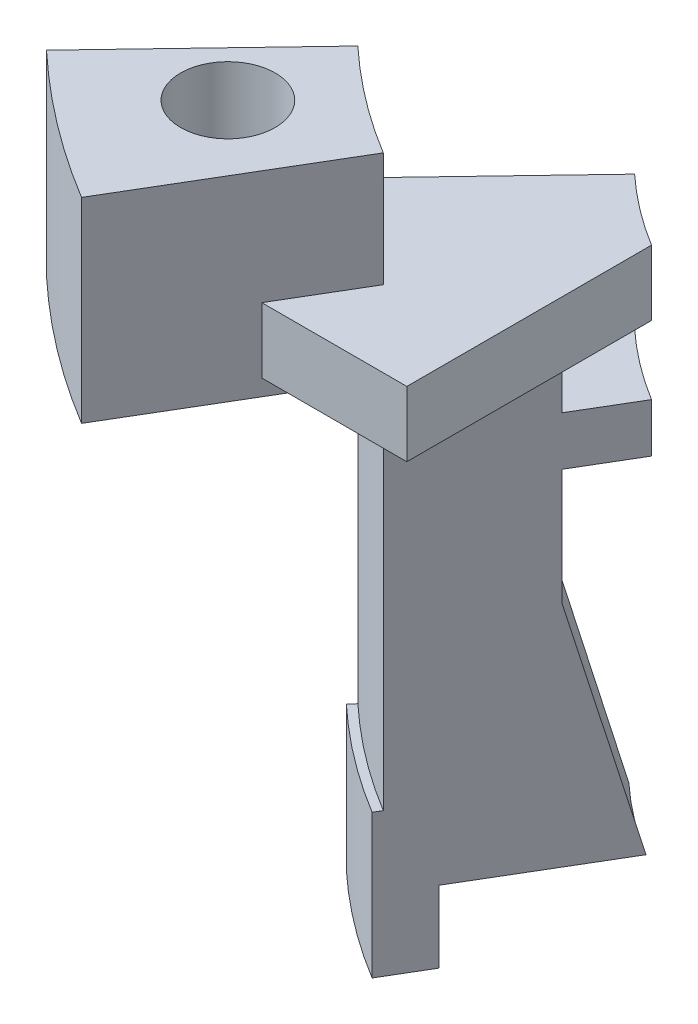
ISO-10303-21;
HEADER;
FILE_DESCRIPTION(('STEP AP214'),'2;1');
FILE_NAME('part.step','',(''),(''),'','','');
FILE_SCHEMA(('AUTOMOTIVE_DESIGN { 1 0 10303 214 1 1 1 1 }'));
ENDSEC;
DATA;
#1=APPLICATION_CONTEXT('core data for automotive mechanical design processes');
#2=APPLICATION_PROTOCOL_DEFINITION('international standard','automotive_design',2000,#1);
#3=PRODUCT_CONTEXT('',#1,'mechanical');
#4=PRODUCT('Part','Part','',(#3));
#5=PRODUCT_RELATED_PRODUCT_CATEGORY('part','',(#4));
#6=PRODUCT_DEFINITION_FORMATION('','',#4);
#7=PRODUCT_DEFINITION_CONTEXT('part definition',#1,'design');
#8=PRODUCT_DEFINITION('design','',#6,#7);
#9=PRODUCT_DEFINITION_SHAPE('','',#8);
#10=(LENGTH_UNIT() NAMED_UNIT(*) SI_UNIT(.MILLI.,.METRE.));
#11=(NAMED_UNIT(*) PLANE_ANGLE_UNIT() SI_UNIT($,.RADIAN.));
#12=(NAMED_UNIT(*) SI_UNIT($,.STERADIAN.) SOLID_ANGLE_UNIT());
#13=UNCERTAINTY_MEASURE_WITH_UNIT(LENGTH_MEASURE(1.E-05),#10,'distance_accuracy_value','');
#14=(GEOMETRIC_REPRESENTATION_CONTEXT(3) GLOBAL_UNCERTAINTY_ASSIGNED_CONTEXT((#13)) GLOBAL_UNIT_ASSIGNED_CONTEXT((#10,
#11,#12)) REPRESENTATION_CONTEXT('',''));
#15=CARTESIAN_POINT('',(0.,0.,0.));
#16=DIRECTION('',(0.,0.,1.));
#17=DIRECTION('',(1.,0.,0.));
#18=AXIS2_PLACEMENT_3D('',#15,#16,#17);
#19=CARTESIAN_POINT('',(0.,-20.2760820693015,0.));
#20=DIRECTION('',(0.,1.,0.));
#21=DIRECTION('',(0.,0.,-1.));
#22=AXIS2_PLACEMENT_3D('',#19,#20,#21);
#23=CYLINDRICAL_SURFACE('',#22,19.6451475);
#24=DIRECTION('',(0.,1.,0.));
#25=VECTOR('',#24,1.);
#26=CARTESIAN_POINT('',(-10.1913484734592,-20.2760820693015,16.7948872157356));
#27=LINE('',#26,#25);
#28=CARTESIAN_POINT('',(-10.1913484734592,-13.4325664147874,16.7948872157356));
#29=VERTEX_POINT('',#28);
#30=CARTESIAN_POINT('',(-10.1913484734592,-1.97167284683422,16.7948872157356));
#31=VERTEX_POINT('',#30);
#32=EDGE_CURVE('E330',#29,#31,#27,.T.);
#33=ORIENTED_EDGE('',*,*,#32,.T.);
#34=CARTESIAN_POINT('',(0.,-1.97167284683422,0.));
#35=DIRECTION('',(0.,-1.,0.));
#36=DIRECTION('',(0.,0.,-1.));
#37=AXIS2_PLACEMENT_3D('',#34,#35,#36);
#38=CIRCLE('',#37,19.6451475);
#39=CARTESIAN_POINT('',(-13.4188244794701,-1.97167284683422,14.3480650223621));
#40=VERTEX_POINT('',#39);
#41=EDGE_CURVE('E333',#31,#40,#38,.T.);
#42=ORIENTED_EDGE('',*,*,#41,.T.);
#43=DIRECTION('',(0.,-1.,0.));
#44=VECTOR('',#43,1.);
#45=CARTESIAN_POINT('',(-13.4188244794701,-20.2760820693015,14.3480650223621));
#46=LINE('',#45,#44);
#47=CARTESIAN_POINT('',(-13.4188244794701,-13.4325664147874,14.3480650223621));
#48=VERTEX_POINT('',#47);
#49=EDGE_CURVE('E433',#40,#48,#46,.T.);
#50=ORIENTED_EDGE('',*,*,#49,.T.);
#51=CARTESIAN_POINT('',(0.,-13.4325664147874,0.));
#52=DIRECTION('',(0.,-1.,0.));
#53=DIRECTION('',(0.,0.,-1.));
#54=AXIS2_PLACEMENT_3D('',#51,#52,#53);
#55=CIRCLE('',#54,19.6451475);
#56=EDGE_CURVE('E335',#29,#48,#55,.T.);
#57=ORIENTED_EDGE('',*,*,#56,.F.);
#58=EDGE_LOOP('',(#33,#42,#50,#57));
#59=FACE_BOUND('',#58,.T.);
#60=ADVANCED_FACE('F37',(#59),#23,.T.);
#61=CARTESIAN_POINT('',(0.,-1.97167284683422,0.));
#62=DIRECTION('',(0.,-1.,0.));
#63=DIRECTION('',(0.,0.,1.));
#64=AXIS2_PLACEMENT_3D('',#61,#62,#63);
#65=PLANE('',#64);
#66=CARTESIAN_POINT('',(-13.97,-1.97167284683422,17.78));
#67=DIRECTION('',(0.,1.,0.));
#68=DIRECTION('',(0.,0.,1.));
#69=AXIS2_PLACEMENT_3D('',#66,#67,#68);
#70=CIRCLE('',#69,1.44999999999999);
#71=CARTESIAN_POINT('',(-13.97,-1.97167284683422,19.23));
#72=VERTEX_POINT('',#71);
#73=EDGE_CURVE('E204',#72,#72,#70,.T.);
#74=ORIENTED_EDGE('',*,*,#73,.T.);
#75=EDGE_LOOP('',(#74));
#76=FACE_BOUND('',#75,.T.);
#77=DIRECTION('',(-0.510041360895566,0.,0.860149876577216));
#78=VECTOR('',#77,1.);
#79=CARTESIAN_POINT('',(-0.172029975315443,-1.97167284683422,-0.102008272179114));
#80=LINE('',#79,#78);
#81=CARTESIAN_POINT('',(-13.634260455702,-1.97167284683422,22.6011228343381));
#82=VERTEX_POINT('',#81);
#83=EDGE_CURVE('E336',#31,#82,#80,.T.);
#84=ORIENTED_EDGE('',*,*,#83,.T.);
#85=CARTESIAN_POINT('',(0.,-1.97167284683422,0.));
#86=DIRECTION('',(0.,-1.,0.));
#87=DIRECTION('',(0.,0.,-1.));
#88=AXIS2_PLACEMENT_3D('',#85,#86,#87);
#89=CIRCLE('',#88,26.3951475);
#90=CARTESIAN_POINT('',(-18.0796136748314,-1.97167284683422,19.2310005177995));
#91=VERTEX_POINT('',#90);
#92=EDGE_CURVE('E391',#82,#91,#89,.T.);
#93=ORIENTED_EDGE('',*,*,#92,.T.);
#94=DIRECTION('',(0.690460655488752,0.,-0.723369949073116));
#95=VECTOR('',#94,1.);
#96=CARTESIAN_POINT('',(0.144673989814624,-1.97167284683422,0.13809213109775));
#97=LINE('',#96,#95);
#98=EDGE_CURVE('E344',#91,#40,#97,.T.);
#99=ORIENTED_EDGE('',*,*,#98,.T.);
#100=ORIENTED_EDGE('',*,*,#41,.F.);
#101=EDGE_LOOP('',(#84,#93,#99,#100));
#102=FACE_BOUND('',#101,.T.);
#103=ADVANCED_FACE('F39',(#76,#102),#65,.T.);
#104=CARTESIAN_POINT('',(0.,-20.2760820693015,0.));
#105=DIRECTION('',(0.,1.,0.));
#106=DIRECTION('',(0.,0.,-1.));
#107=AXIS2_PLACEMENT_3D('',#104,#105,#106);
#108=CYLINDRICAL_SURFACE('',#107,26.3951475);
#109=DIRECTION('',(0.,1.,0.));
#110=VECTOR('',#109,1.);
#111=CARTESIAN_POINT('',(-13.634260455702,-20.2760820693015,22.6011228343381));
#112=LINE('',#111,#110);
#113=CARTESIAN_POINT('',(-13.634260455702,4.02832715316578,22.6011228343381));
#114=VERTEX_POINT('',#113);
#115=EDGE_CURVE('E61',#82,#114,#112,.T.);
#116=ORIENTED_EDGE('',*,*,#115,.T.);
#117=CARTESIAN_POINT('',(0.,4.02832715316578,0.));
#118=DIRECTION('',(0.,-1.,0.));
#119=DIRECTION('',(0.,0.,-1.));
#120=AXIS2_PLACEMENT_3D('',#117,#118,#119);
#121=CIRCLE('',#120,26.3951475);
#122=CARTESIAN_POINT('',(-18.0796136748314,4.02832715316578,19.2310005177995));
#123=VERTEX_POINT('',#122);
#124=EDGE_CURVE('E388',#114,#123,#121,.T.);
#125=ORIENTED_EDGE('',*,*,#124,.T.);
#126=DIRECTION('',(0.,-1.,0.));
#127=VECTOR('',#126,1.);
#128=CARTESIAN_POINT('',(-18.0796136748314,-20.2760820693015,19.2310005177995));
#129=LINE('',#128,#127);
#130=EDGE_CURVE('E211',#123,#91,#129,.T.);
#131=ORIENTED_EDGE('',*,*,#130,.T.);
#132=ORIENTED_EDGE('',*,*,#92,.F.);
#133=EDGE_LOOP('',(#116,#125,#131,#132));
#134=FACE_BOUND('',#133,.T.);
#135=ADVANCED_FACE('F314',(#134),#108,.T.);
#136=CARTESIAN_POINT('',(0.,4.02832715316578,0.));
#137=DIRECTION('',(0.,-1.,0.));
#138=DIRECTION('',(0.,0.,1.));
#139=AXIS2_PLACEMENT_3D('',#136,#137,#138);
#140=PLANE('',#139);
#141=CARTESIAN_POINT('',(-13.97,4.02832715316578,17.78));
#142=DIRECTION('',(0.,1.,0.));
#143=DIRECTION('',(0.,0.,1.));
#144=AXIS2_PLACEMENT_3D('',#141,#142,#143);
#145=CIRCLE('',#144,1.45);
#146=CARTESIAN_POINT('',(-13.97,4.02832715316578,19.23));
#147=VERTEX_POINT('',#146);
#148=EDGE_CURVE('E199',#147,#147,#145,.T.);
#149=ORIENTED_EDGE('',*,*,#148,.F.);
#150=EDGE_LOOP('',(#149));
#151=FACE_BOUND('',#150,.T.);
#152=CARTESIAN_POINT('',(0.,4.02832715316578,0.));
#153=DIRECTION('',(0.,-1.,0.));
#154=DIRECTION('',(0.,0.,-1.));
#155=AXIS2_PLACEMENT_3D('',#152,#153,#154);
#156=CIRCLE('',#155,19.6451475);
#157=CARTESIAN_POINT('',(-10.1913484734592,4.02832715316578,16.7948872157356));
#158=VERTEX_POINT('',#157);
#159=CARTESIAN_POINT('',(-13.4188244794701,4.02832715316578,14.3480650223621));
#160=VERTEX_POINT('',#159);
#161=EDGE_CURVE('E385',#158,#160,#156,.T.);
#162=ORIENTED_EDGE('',*,*,#161,.T.);
#163=DIRECTION('',(0.690460655488752,0.,-0.723369949073116));
#164=VECTOR('',#163,1.);
#165=CARTESIAN_POINT('',(0.144673989814622,4.02832715316578,0.138092131097752));
#166=LINE('',#165,#164);
#167=EDGE_CURVE('E214',#123,#160,#166,.T.);
#168=ORIENTED_EDGE('',*,*,#167,.F.);
#169=ORIENTED_EDGE('',*,*,#124,.F.);
#170=DIRECTION('',(-0.510041360895566,0.,0.860149876577216));
#171=VECTOR('',#170,1.);
#172=CARTESIAN_POINT('',(-0.172029975315444,4.02832715316578,-0.102008272179112));
#173=LINE('',#172,#171);
#174=EDGE_CURVE('E426',#158,#114,#173,.T.);
#175=ORIENTED_EDGE('',*,*,#174,.F.);
#176=EDGE_LOOP('',(#162,#168,#169,#175));
#177=FACE_BOUND('',#176,.T.);
#178=ADVANCED_FACE('F311',(#151,#177),#140,.F.);
#179=CARTESIAN_POINT('',(0.,-20.2760820693015,0.));
#180=DIRECTION('',(0.,1.,0.));
#181=DIRECTION('',(0.,0.,-1.));
#182=AXIS2_PLACEMENT_3D('',#179,#180,#181);
#183=CYLINDRICAL_SURFACE('',#182,19.6451475);
#184=CARTESIAN_POINT('',(0.,0.528327153165784,0.));
#185=DIRECTION('',(0.,-1.,0.));
#186=DIRECTION('',(0.,0.,-1.));
#187=AXIS2_PLACEMENT_3D('',#184,#185,#186);
#188=CIRCLE('',#187,19.6451475);
#189=CARTESIAN_POINT('',(-10.1913484734592,0.528327153165784,16.7948872157356));
#190=VERTEX_POINT('',#189);
#191=CARTESIAN_POINT('',(-13.4188244794701,0.528327153165788,14.3480650223621));
#192=VERTEX_POINT('',#191);
#193=EDGE_CURVE('E382',#190,#192,#188,.T.);
#194=ORIENTED_EDGE('',*,*,#193,.T.);
#195=DIRECTION('',(0.,-1.,0.));
#196=VECTOR('',#195,1.);
#197=CARTESIAN_POINT('',(-13.4188244794701,-20.2760820693015,14.3480650223621));
#198=LINE('',#197,#196);
#199=EDGE_CURVE('E217',#160,#192,#198,.T.);
#200=ORIENTED_EDGE('',*,*,#199,.F.);
#201=ORIENTED_EDGE('',*,*,#161,.F.);
#202=DIRECTION('',(0.,1.,0.));
#203=VECTOR('',#202,1.);
#204=CARTESIAN_POINT('',(-10.1913484734592,-20.2760820693015,16.7948872157356));
#205=LINE('',#204,#203);
#206=EDGE_CURVE('E424',#190,#158,#205,.T.);
#207=ORIENTED_EDGE('',*,*,#206,.F.);
#208=EDGE_LOOP('',(#194,#200,#201,#207));
#209=FACE_BOUND('',#208,.T.);
#210=ADVANCED_FACE('F307',(#209),#183,.F.);
#211=CARTESIAN_POINT('',(0.,0.528327153165786,0.));
#212=DIRECTION('',(0.,1.,0.));
#213=DIRECTION('',(0.,0.,-1.));
#214=AXIS2_PLACEMENT_3D('',#211,#212,#213);
#215=PLANE('',#214);
#216=CARTESIAN_POINT('',(0.,0.528327153165788,0.));
#217=DIRECTION('',(0.,-1.,0.));
#218=DIRECTION('',(0.,0.,-1.));
#219=AXIS2_PLACEMENT_3D('',#216,#217,#218);
#220=CIRCLE('',#219,13.6451475);
#221=CARTESIAN_POINT('',(-7.1308719565709,0.528327153165784,11.633602857058));
#222=VERTEX_POINT('',#221);
#223=CARTESIAN_POINT('',(-9.27575141918295,0.528327153165788,10.007521466691));
#224=VERTEX_POINT('',#223);
#225=EDGE_CURVE('E379',#222,#224,#220,.T.);
#226=ORIENTED_EDGE('',*,*,#225,.T.);
#227=DIRECTION('',(-0.690460655488752,0.,0.723369949073116));
#228=VECTOR('',#227,1.);
#229=CARTESIAN_POINT('',(0.144673989814623,0.528327153165786,0.138092131097751));
#230=LINE('',#229,#228);
#231=EDGE_CURVE('E220',#224,#192,#230,.T.);
#232=ORIENTED_EDGE('',*,*,#231,.T.);
#233=ORIENTED_EDGE('',*,*,#193,.F.);
#234=DIRECTION('',(-0.510041360895566,0.,0.860149876577216));
#235=VECTOR('',#234,1.);
#236=CARTESIAN_POINT('',(-0.172029975315441,0.528327153165786,-0.102008272179112));
#237=LINE('',#236,#235);
#238=CARTESIAN_POINT('',(-11.5781320340108,0.528327153165789,19.133602857058));
#239=VERTEX_POINT('',#238);
#240=EDGE_CURVE('E11',#190,#239,#237,.T.);
#241=ORIENTED_EDGE('',*,*,#240,.T.);
#242=DIRECTION('',(-1.,0.,0.));
#243=VECTOR('',#242,1.);
#244=CARTESIAN_POINT('',(0.,0.528327153165786,19.133602857058));
#245=LINE('',#244,#243);
#246=CARTESIAN_POINT('',(-7.1308719565709,0.528327153165786,19.133602857058));
#247=VERTEX_POINT('',#246);
#248=EDGE_CURVE('E185',#247,#239,#245,.T.);
#249=ORIENTED_EDGE('',*,*,#248,.F.);
#250=DIRECTION('',(0.,0.,1.));
#251=VECTOR('',#250,1.);
#252=CARTESIAN_POINT('',(-7.1308719565709,0.528327153165786,0.));
#253=LINE('',#252,#251);
#254=EDGE_CURVE('E201',#222,#247,#253,.T.);
#255=ORIENTED_EDGE('',*,*,#254,.F.);
#256=EDGE_LOOP('',(#226,#232,#233,#241,#249,#255));
#257=FACE_BOUND('',#256,.T.);
#258=ADVANCED_FACE('F303',(#257),#215,.T.);
#259=CARTESIAN_POINT('',(0.,-20.2760820693015,0.));
#260=DIRECTION('',(0.,1.,0.));
#261=DIRECTION('',(0.,0.,-1.));
#262=AXIS2_PLACEMENT_3D('',#259,#260,#261);
#263=CYLINDRICAL_SURFACE('',#262,13.6451475);
#264=CARTESIAN_POINT('',(0.,-1.47167284683421,0.));
#265=DIRECTION('',(0.,-1.,0.));
#266=DIRECTION('',(0.,0.,-1.));
#267=AXIS2_PLACEMENT_3D('',#264,#265,#266);
#268=CIRCLE('',#267,13.6451475);
#269=CARTESIAN_POINT('',(-7.1308719565709,-1.47167284683421,11.633602857058));
#270=VERTEX_POINT('',#269);
#271=CARTESIAN_POINT('',(-9.27575141918295,-1.47167284683421,10.007521466691));
#272=VERTEX_POINT('',#271);
#273=EDGE_CURVE('E376',#270,#272,#268,.T.);
#274=ORIENTED_EDGE('',*,*,#273,.T.);
#275=DIRECTION('',(0.,-1.,0.));
#276=VECTOR('',#275,1.);
#277=CARTESIAN_POINT('',(-9.27575141918295,-20.2760820693015,10.007521466691));
#278=LINE('',#277,#276);
#279=EDGE_CURVE('E222',#224,#272,#278,.T.);
#280=ORIENTED_EDGE('',*,*,#279,.F.);
#281=ORIENTED_EDGE('',*,*,#225,.F.);
#282=DIRECTION('',(0.,1.,0.));
#283=VECTOR('',#282,1.);
#284=CARTESIAN_POINT('',(-7.1308719565709,-20.2760820693015,11.633602857058));
#285=LINE('',#284,#283);
#286=EDGE_CURVE('E422',#270,#222,#285,.T.);
#287=ORIENTED_EDGE('',*,*,#286,.F.);
#288=EDGE_LOOP('',(#274,#280,#281,#287));
#289=FACE_BOUND('',#288,.T.);
#290=ADVANCED_FACE('F300',(#289),#263,.F.);
#291=CARTESIAN_POINT('',(0.,-1.47167284683421,0.));
#292=DIRECTION('',(0.,-1.,0.));
#293=DIRECTION('',(0.,0.,1.));
#294=AXIS2_PLACEMENT_3D('',#291,#292,#293);
#295=PLANE('',#294);
#296=CARTESIAN_POINT('',(0.,-1.47167284683421,0.));
#297=DIRECTION('',(0.,-1.,0.));
#298=DIRECTION('',(0.,0.,-1.));
#299=AXIS2_PLACEMENT_3D('',#296,#297,#298);
#300=CIRCLE('',#299,15.6451475);
#301=CARTESIAN_POINT('',(-8.15105025877613,-1.47167284683422,13.3540638000446));
#302=VERTEX_POINT('',#301);
#303=CARTESIAN_POINT('',(-10.6568021206774,-1.47167284683421,11.4543969224696));
#304=VERTEX_POINT('',#303);
#305=EDGE_CURVE('E374',#302,#304,#300,.T.);
#306=ORIENTED_EDGE('',*,*,#305,.T.);
#307=DIRECTION('',(0.690460655488752,0.,-0.723369949073116));
#308=VECTOR('',#307,1.);
#309=CARTESIAN_POINT('',(0.144673989814623,-1.47167284683421,0.138092131097751));
#310=LINE('',#309,#308);
#311=EDGE_CURVE('E225',#304,#272,#310,.T.);
#312=ORIENTED_EDGE('',*,*,#311,.T.);
#313=ORIENTED_EDGE('',*,*,#273,.F.);
#314=DIRECTION('',(0.,0.,1.));
#315=VECTOR('',#314,1.);
#316=CARTESIAN_POINT('',(-7.1308719565709,-1.47167284683421,0.));
#317=LINE('',#316,#315);
#318=CARTESIAN_POINT('',(-7.1308719565709,-1.47167284683421,19.133602857058));
#319=VERTEX_POINT('',#318);
#320=EDGE_CURVE('E198',#270,#319,#317,.T.);
#321=ORIENTED_EDGE('',*,*,#320,.T.);
#322=DIRECTION('',(-1.,0.,0.));
#323=VECTOR('',#322,1.);
#324=CARTESIAN_POINT('',(0.,-1.47167284683421,19.133602857058));
#325=LINE('',#324,#323);
#326=CARTESIAN_POINT('',(-11.5781320340108,-1.47167284683421,19.133602857058));
#327=VERTEX_POINT('',#326);
#328=EDGE_CURVE('E182',#319,#327,#325,.T.);
#329=ORIENTED_EDGE('',*,*,#328,.T.);
#330=DIRECTION('',(-0.510041360895566,0.,0.860149876577216));
#331=VECTOR('',#330,1.);
#332=CARTESIAN_POINT('',(-0.172029975315441,-1.47167284683421,-0.102008272179112));
#333=LINE('',#332,#331);
#334=EDGE_CURVE('E46',#302,#327,#333,.T.);
#335=ORIENTED_EDGE('',*,*,#334,.F.);
#336=EDGE_LOOP('',(#306,#312,#313,#321,#329,#335));
#337=FACE_BOUND('',#336,.T.);
#338=ADVANCED_FACE('F196',(#337),#295,.T.);
#339=CARTESIAN_POINT('',(0.,-20.2760820693015,0.));
#340=DIRECTION('',(0.,1.,0.));
#341=DIRECTION('',(0.,0.,-1.));
#342=AXIS2_PLACEMENT_3D('',#339,#340,#341);
#343=CYLINDRICAL_SURFACE('',#342,15.6451475);
#344=DIRECTION('',(0.,1.,0.));
#345=VECTOR('',#344,1.);
#346=CARTESIAN_POINT('',(-8.15105025877613,-20.2760820693015,13.3540638000446));
#347=LINE('',#346,#345);
#348=CARTESIAN_POINT('',(-8.15105025877613,-3.57167284683421,13.3540638000446));
#349=VERTEX_POINT('',#348);
#350=EDGE_CURVE('E191',#302,#349,#347,.F.);
#351=ORIENTED_EDGE('',*,*,#350,.T.);
#352=CARTESIAN_POINT('',(0.,-3.57167284683421,0.));
#353=DIRECTION('',(0.,-1.,0.));
#354=DIRECTION('',(0.,0.,-1.));
#355=AXIS2_PLACEMENT_3D('',#352,#353,#354);
#356=CIRCLE('',#355,15.6451475);
#357=CARTESIAN_POINT('',(-10.6568021206774,-3.57167284683421,11.4543969224696));
#358=VERTEX_POINT('',#357);
#359=EDGE_CURVE('E371',#349,#358,#356,.T.);
#360=ORIENTED_EDGE('',*,*,#359,.T.);
#361=DIRECTION('',(0.,-1.,0.));
#362=VECTOR('',#361,1.);
#363=CARTESIAN_POINT('',(-10.6568021206774,-20.2760820693015,11.4543969224696));
#364=LINE('',#363,#362);
#365=EDGE_CURVE('E227',#358,#304,#364,.F.);
#366=ORIENTED_EDGE('',*,*,#365,.T.);
#367=ORIENTED_EDGE('',*,*,#305,.F.);
#368=EDGE_LOOP('',(#351,#360,#366,#367));
#369=FACE_BOUND('',#368,.T.);
#370=ADVANCED_FACE('F286',(#369),#343,.F.);
#371=CARTESIAN_POINT('',(0.,-3.57167284683421,0.));
#372=DIRECTION('',(0.,-1.,0.));
#373=DIRECTION('',(0.,0.,1.));
#374=AXIS2_PLACEMENT_3D('',#371,#372,#373);
#375=PLANE('',#374);
#376=CARTESIAN_POINT('',(0.,-3.57167284683421,0.));
#377=DIRECTION('',(0.,-1.,0.));
#378=DIRECTION('',(0.,0.,-1.));
#379=AXIS2_PLACEMENT_3D('',#376,#377,#378);
#380=CIRCLE('',#379,13.6451475);
#381=CARTESIAN_POINT('',(-7.1308719565709,-3.57167284683421,11.633602857058));
#382=VERTEX_POINT('',#381);
#383=CARTESIAN_POINT('',(-9.27575141918295,-3.57167284683421,10.007521466691));
#384=VERTEX_POINT('',#383);
#385=EDGE_CURVE('E368',#382,#384,#380,.T.);
#386=ORIENTED_EDGE('',*,*,#385,.T.);
#387=DIRECTION('',(0.690460655488752,0.,-0.723369949073116));
#388=VECTOR('',#387,1.);
#389=CARTESIAN_POINT('',(0.144673989814623,-3.57167284683421,0.138092131097751));
#390=LINE('',#389,#388);
#391=EDGE_CURVE('E229',#358,#384,#390,.T.);
#392=ORIENTED_EDGE('',*,*,#391,.F.);
#393=ORIENTED_EDGE('',*,*,#359,.F.);
#394=DIRECTION('',(-0.510041360895566,0.,0.860149876577216));
#395=VECTOR('',#394,1.);
#396=CARTESIAN_POINT('',(-0.172029975315443,-3.57167284683421,-0.102008272179113));
#397=LINE('',#396,#395);
#398=EDGE_CURVE('E417',#382,#349,#397,.T.);
#399=ORIENTED_EDGE('',*,*,#398,.F.);
#400=EDGE_LOOP('',(#386,#392,#393,#399));
#401=FACE_BOUND('',#400,.T.);
#402=ADVANCED_FACE('F293',(#401),#375,.F.);
#403=CARTESIAN_POINT('',(0.,-20.2760820693015,0.));
#404=DIRECTION('',(0.,1.,0.));
#405=DIRECTION('',(0.,0.,-1.));
#406=AXIS2_PLACEMENT_3D('',#403,#404,#405);
#407=CYLINDRICAL_SURFACE('',#406,13.6451475);
#408=CARTESIAN_POINT('',(0.,-5.07167284683421,0.));
#409=DIRECTION('',(0.,-1.,0.));
#410=DIRECTION('',(0.,0.,-1.));
#411=AXIS2_PLACEMENT_3D('',#408,#409,#410);
#412=CIRCLE('',#411,13.6451475);
#413=CARTESIAN_POINT('',(-7.1308719565709,-5.07167284683421,11.633602857058));
#414=VERTEX_POINT('',#413);
#415=CARTESIAN_POINT('',(-9.27575141918295,-5.07167284683421,10.007521466691));
#416=VERTEX_POINT('',#415);
#417=EDGE_CURVE('E365',#414,#416,#412,.T.);
#418=ORIENTED_EDGE('',*,*,#417,.T.);
#419=DIRECTION('',(0.,-1.,0.));
#420=VECTOR('',#419,1.);
#421=CARTESIAN_POINT('',(-9.27575141918295,-20.2760820693015,10.007521466691));
#422=LINE('',#421,#420);
#423=EDGE_CURVE('E232',#384,#416,#422,.T.);
#424=ORIENTED_EDGE('',*,*,#423,.F.);
#425=ORIENTED_EDGE('',*,*,#385,.F.);
#426=DIRECTION('',(0.,1.,0.));
#427=VECTOR('',#426,1.);
#428=CARTESIAN_POINT('',(-7.1308719565709,-20.2760820693015,11.633602857058));
#429=LINE('',#428,#427);
#430=EDGE_CURVE('E415',#414,#382,#429,.T.);
#431=ORIENTED_EDGE('',*,*,#430,.F.);
#432=EDGE_LOOP('',(#418,#424,#425,#431));
#433=FACE_BOUND('',#432,.T.);
#434=ADVANCED_FACE('F289',(#433),#407,.F.);
#435=CARTESIAN_POINT('',(0.,-5.07167284683421,0.));
#436=DIRECTION('',(0.,-1.,0.));
#437=DIRECTION('',(0.,0.,1.));
#438=AXIS2_PLACEMENT_3D('',#435,#436,#437);
#439=PLANE('',#438);
#440=DIRECTION('',(-0.510041360895566,0.,0.860149876577216));
#441=VECTOR('',#440,1.);
#442=CARTESIAN_POINT('',(-0.172029975315443,-5.07167284683421,-0.102008272179113));
#443=LINE('',#442,#441);
#444=CARTESIAN_POINT('',(-8.15105025877613,-5.07167284683421,13.3540638000446));
#445=VERTEX_POINT('',#444);
#446=EDGE_CURVE('E414',#414,#445,#443,.T.);
#447=ORIENTED_EDGE('',*,*,#446,.T.);
#448=CARTESIAN_POINT('',(0.,-5.07167284683421,0.));
#449=DIRECTION('',(0.,-1.,0.));
#450=DIRECTION('',(0.,0.,-1.));
#451=AXIS2_PLACEMENT_3D('',#448,#449,#450);
#452=CIRCLE('',#451,15.6451475);
#453=CARTESIAN_POINT('',(-10.6568021206774,-5.07167284683421,11.4543969224696));
#454=VERTEX_POINT('',#453);
#455=EDGE_CURVE('E362',#445,#454,#452,.T.);
#456=ORIENTED_EDGE('',*,*,#455,.T.);
#457=DIRECTION('',(0.690460655488752,0.,-0.723369949073116));
#458=VECTOR('',#457,1.);
#459=CARTESIAN_POINT('',(0.144673989814623,-5.07167284683421,0.138092131097751));
#460=LINE('',#459,#458);
#461=EDGE_CURVE('E235',#454,#416,#460,.T.);
#462=ORIENTED_EDGE('',*,*,#461,.T.);
#463=ORIENTED_EDGE('',*,*,#417,.F.);
#464=EDGE_LOOP('',(#447,#456,#462,#463));
#465=FACE_BOUND('',#464,.T.);
#466=ADVANCED_FACE('F284',(#465),#439,.T.);
#467=DIRECTION('',(0.,1.,0.));
#468=VECTOR('',#467,1.);
#469=CARTESIAN_POINT('',(-8.15105025877613,-20.2760820693015,13.3540638000446));
#470=LINE('',#469,#468);
#471=CARTESIAN_POINT('',(-8.15105025877613,-8.63256641478738,13.3540638000446));
#472=VERTEX_POINT('',#471);
#473=EDGE_CURVE('E269',#445,#472,#470,.F.);
#474=ORIENTED_EDGE('',*,*,#473,.T.);
#475=CARTESIAN_POINT('',(0.,-8.63256641478738,0.));
#476=DIRECTION('',(0.,-1.,0.));
#477=DIRECTION('',(0.,0.,-1.));
#478=AXIS2_PLACEMENT_3D('',#475,#476,#477);
#479=CIRCLE('',#478,15.6451475);
#480=CARTESIAN_POINT('',(-10.6568021206774,-8.63256641478738,11.4543969224696));
#481=VERTEX_POINT('',#480);
#482=EDGE_CURVE('E359',#472,#481,#479,.T.);
#483=ORIENTED_EDGE('',*,*,#482,.T.);
#484=DIRECTION('',(0.,-1.,0.));
#485=VECTOR('',#484,1.);
#486=CARTESIAN_POINT('',(-10.6568021206774,-20.2760820693015,11.4543969224696));
#487=LINE('',#486,#485);
#488=EDGE_CURVE('E237',#481,#454,#487,.F.);
#489=ORIENTED_EDGE('',*,*,#488,.T.);
#490=ORIENTED_EDGE('',*,*,#455,.F.);
#491=EDGE_LOOP('',(#474,#483,#489,#490));
#492=FACE_BOUND('',#491,.T.);
#493=ADVANCED_FACE('F279',(#492),#343,.F.);
#494=CARTESIAN_POINT('',(0.,-8.63256641478738,0.));
#495=DIRECTION('',(0.,1.,0.));
#496=DIRECTION('',(0.,0.,-1.));
#497=AXIS2_PLACEMENT_3D('',#494,#495,#496);
#498=CONICAL_SURFACE('',#497,15.6451475,0.261799387799143);
#499=CARTESIAN_POINT('',(0.,-15.6325664147874,0.));
#500=DIRECTION('',(0.,-1.,0.));
#501=DIRECTION('',(0.,0.,-1.));
#502=AXIS2_PLACEMENT_3D('',#499,#500,#501);
#503=CIRCLE('',#502,13.7695031529822);
#504=CARTESIAN_POINT('',(-7.19430523569571,-15.6325664147874,11.7405787444924));
#505=VERTEX_POINT('',#504);
#506=CARTESIAN_POINT('',(-9.36162324614109,-15.6325664147874,10.0974861860414));
#507=VERTEX_POINT('',#506);
#508=EDGE_CURVE('E356',#505,#507,#503,.T.);
#509=ORIENTED_EDGE('',*,*,#508,.T.);
#510=CARTESIAN_POINT('',(-10.6568391253762,-8.63236641478738,11.4544356909162));
#511=CARTESIAN_POINT('',(-10.4409660298588,-9.79910067387135,11.2282734775166));
#512=CARTESIAN_POINT('',(-10.2250917416989,-10.9658344700799,11.0021100146298));
#513=CARTESIAN_POINT('',(-9.79334078009429,-13.2993011367466,10.549780589882));
#514=CARTESIAN_POINT('',(-9.57746410664951,-14.4660340072047,10.323614628021));
#515=CARTESIAN_POINT('',(-9.36158624056231,-15.6327664147874,10.0974474166728));
#516=B_SPLINE_CURVE_WITH_KNOTS('',3,(#510,#511,#512,#513,#514,#515),.UNSPECIFIED.,.F.,.F.,(4,2,
4),(0.,3.62369622665012,7.24739245330126),.UNSPECIFIED.);
#517=EDGE_CURVE('E239',#481,#507,#516,.T.);
#518=ORIENTED_EDGE('',*,*,#517,.F.);
#519=ORIENTED_EDGE('',*,*,#482,.F.);
#520=CARTESIAN_POINT('',(-7.19427789977785,-15.6327664147874,11.7405326443363));
#521=CARTESIAN_POINT('',(-7.35374627749216,-14.4660340072047,12.0094651582957));
#522=CARTESIAN_POINT('',(-7.51321377420483,-13.2993011367466,12.2783961865061));
#523=CARTESIAN_POINT('',(-7.83214700562685,-10.9658344700799,12.8162552714289));
#524=CARTESIAN_POINT('',(-7.9916127403362,-9.79910067387135,13.0851833281412));
#525=CARTESIAN_POINT('',(-8.15107759404391,-8.63236641478738,13.3541098991044));
#526=B_SPLINE_CURVE_WITH_KNOTS('',3,(#520,#521,#522,#523,#524,#525),.UNSPECIFIED.,.F.,.F.,(4,2,
4),(0.,3.62369622665113,7.24739245330126),.UNSPECIFIED.);
#527=EDGE_CURVE('E261',#505,#472,#526,.T.);
#528=ORIENTED_EDGE('',*,*,#527,.F.);
#529=EDGE_LOOP('',(#509,#518,#519,#528));
#530=FACE_BOUND('',#529,.T.);
#531=ADVANCED_FACE('F273',(#530),#498,.F.);
#532=CARTESIAN_POINT('',(0.,-15.6325664147874,0.));
#533=DIRECTION('',(0.,-1.,0.));
#534=DIRECTION('',(0.,0.,1.));
#535=AXIS2_PLACEMENT_3D('',#532,#533,#534);
#536=PLANE('',#535);
#537=DIRECTION('',(-0.510041360895566,0.,0.860149876577216));
#538=VECTOR('',#537,1.);
#539=CARTESIAN_POINT('',(-0.172029975315443,-15.6325664147874,-0.102008272179113));
#540=LINE('',#539,#538);
#541=CARTESIAN_POINT('',(-9.55376148467298,-15.6325664147874,15.7196403597772));
#542=VERTEX_POINT('',#541);
#543=EDGE_CURVE('E270',#505,#542,#540,.T.);
#544=ORIENTED_EDGE('',*,*,#543,.T.);
#545=CARTESIAN_POINT('',(0.,-15.6325664147874,0.));
#546=DIRECTION('',(0.,-1.,0.));
#547=DIRECTION('',(0.,0.,-1.));
#548=AXIS2_PLACEMENT_3D('',#545,#546,#547);
#549=CIRCLE('',#548,18.3951475);
#550=CARTESIAN_POINT('',(-12.5557008899725,-15.6325664147874,13.4438025390252));
#551=VERTEX_POINT('',#550);
#552=EDGE_CURVE('E353',#542,#551,#549,.T.);
#553=ORIENTED_EDGE('',*,*,#552,.T.);
#554=DIRECTION('',(0.690460655488752,0.,-0.723369949073116));
#555=VECTOR('',#554,1.);
#556=CARTESIAN_POINT('',(0.144673989814623,-15.6325664147874,0.138092131097751));
#557=LINE('',#556,#555);
#558=EDGE_CURVE('E248',#551,#507,#557,.T.);
#559=ORIENTED_EDGE('',*,*,#558,.T.);
#560=ORIENTED_EDGE('',*,*,#508,.F.);
#561=EDGE_LOOP('',(#544,#553,#559,#560));
#562=FACE_BOUND('',#561,.T.);
#563=ADVANCED_FACE('F278',(#562),#536,.T.);
#564=CARTESIAN_POINT('',(0.,-20.2760820693015,0.));
#565=DIRECTION('',(0.,1.,0.));
#566=DIRECTION('',(0.,0.,-1.));
#567=AXIS2_PLACEMENT_3D('',#564,#565,#566);
#568=CYLINDRICAL_SURFACE('',#567,18.3951475);
#569=CARTESIAN_POINT('',(0.,-17.8325664147874,0.));
#570=DIRECTION('',(0.,-1.,0.));
#571=DIRECTION('',(0.,0.,-1.));
#572=AXIS2_PLACEMENT_3D('',#569,#570,#571);
#573=CIRCLE('',#572,18.3951475);
#574=CARTESIAN_POINT('',(-9.55376148467298,-17.8325664147874,15.7196403597772));
#575=VERTEX_POINT('',#574);
#576=CARTESIAN_POINT('',(-12.5557008899725,-17.8325664147874,13.4438025390252));
#577=VERTEX_POINT('',#576);
#578=EDGE_CURVE('E350',#575,#577,#573,.T.);
#579=ORIENTED_EDGE('',*,*,#578,.T.);
#580=DIRECTION('',(0.,-1.,0.));
#581=VECTOR('',#580,1.);
#582=CARTESIAN_POINT('',(-12.5557008899725,-20.2760820693015,13.4438025390252));
#583=LINE('',#582,#581);
#584=EDGE_CURVE('E442',#551,#577,#583,.T.);
#585=ORIENTED_EDGE('',*,*,#584,.F.);
#586=ORIENTED_EDGE('',*,*,#552,.F.);
#587=DIRECTION('',(0.,1.,0.));
#588=VECTOR('',#587,1.);
#589=CARTESIAN_POINT('',(-9.55376148467298,-20.2760820693015,15.7196403597772));
#590=LINE('',#589,#588);
#591=EDGE_CURVE('E399',#575,#542,#590,.T.);
#592=ORIENTED_EDGE('',*,*,#591,.F.);
#593=EDGE_LOOP('',(#579,#585,#586,#592));
#594=FACE_BOUND('',#593,.T.);
#595=ADVANCED_FACE('F502',(#594),#568,.F.);
#596=CARTESIAN_POINT('',(0.,-17.8325664147874,0.));
#597=DIRECTION('',(0.,1.,0.));
#598=DIRECTION('',(0.,0.,-1.));
#599=AXIS2_PLACEMENT_3D('',#596,#597,#598);
#600=PLANE('',#599);
#601=CARTESIAN_POINT('',(0.,-17.8325664147874,0.));
#602=DIRECTION('',(0.,-1.,0.));
#603=DIRECTION('',(0.,0.,-1.));
#604=AXIS2_PLACEMENT_3D('',#601,#602,#603);
#605=CIRCLE('',#604,19.8951475);
#606=CARTESIAN_POINT('',(-10.3188653390702,-17.8325664147874,17.009935689499));
#607=VERTEX_POINT('',#606);
#608=CARTESIAN_POINT('',(-13.5914484769848,-17.8325664147874,14.5289167643091));
#609=VERTEX_POINT('',#608);
#610=EDGE_CURVE('E347',#607,#609,#605,.T.);
#611=ORIENTED_EDGE('',*,*,#610,.T.);
#612=DIRECTION('',(-0.690460655488752,0.,0.723369949073116));
#613=VECTOR('',#612,1.);
#614=CARTESIAN_POINT('',(0.144673989814623,-17.8325664147874,0.138092131097751));
#615=LINE('',#614,#613);
#616=EDGE_CURVE('E440',#577,#609,#615,.T.);
#617=ORIENTED_EDGE('',*,*,#616,.F.);
#618=ORIENTED_EDGE('',*,*,#578,.F.);
#619=DIRECTION('',(0.510041360895566,0.,-0.860149876577216));
#620=VECTOR('',#619,1.);
#621=CARTESIAN_POINT('',(-0.172029975315443,-17.8325664147874,-0.102008272179113));
#622=LINE('',#621,#620);
#623=EDGE_CURVE('E395',#607,#575,#622,.T.);
#624=ORIENTED_EDGE('',*,*,#623,.F.);
#625=EDGE_LOOP('',(#611,#617,#618,#624));
#626=FACE_BOUND('',#625,.T.);
#627=ADVANCED_FACE('F495',(#626),#600,.F.);
#628=CARTESIAN_POINT('',(0.,-20.2760820693015,0.));
#629=DIRECTION('',(0.,1.,0.));
#630=DIRECTION('',(0.,0.,-1.));
#631=AXIS2_PLACEMENT_3D('',#628,#629,#630);
#632=CYLINDRICAL_SURFACE('',#631,19.8951475);
#633=DIRECTION('',(0.,1.,0.));
#634=VECTOR('',#633,1.);
#635=CARTESIAN_POINT('',(-10.3188653390702,-20.2760820693015,17.009935689499));
#636=LINE('',#635,#634);
#637=CARTESIAN_POINT('',(-10.3188653390702,-13.4325664147874,17.009935689499));
#638=VERTEX_POINT('',#637);
#639=EDGE_CURVE('E393',#607,#638,#636,.T.);
#640=ORIENTED_EDGE('',*,*,#639,.T.);
#641=CARTESIAN_POINT('',(0.,-13.4325664147874,0.));
#642=DIRECTION('',(0.,-1.,0.));
#643=DIRECTION('',(0.,0.,-1.));
#644=AXIS2_PLACEMENT_3D('',#641,#642,#643);
#645=CIRCLE('',#644,19.8951475);
#646=CARTESIAN_POINT('',(-13.5914484769848,-13.4325664147874,14.5289167643091));
#647=VERTEX_POINT('',#646);
#648=EDGE_CURVE('E343',#638,#647,#645,.T.);
#649=ORIENTED_EDGE('',*,*,#648,.T.);
#650=DIRECTION('',(0.,-1.,0.));
#651=VECTOR('',#650,1.);
#652=CARTESIAN_POINT('',(-13.5914484769848,-20.2760820693015,14.5289167643091));
#653=LINE('',#652,#651);
#654=EDGE_CURVE('E436',#647,#609,#653,.T.);
#655=ORIENTED_EDGE('',*,*,#654,.T.);
#656=ORIENTED_EDGE('',*,*,#610,.F.);
#657=EDGE_LOOP('',(#640,#649,#655,#656));
#658=FACE_BOUND('',#657,.T.);
#659=ADVANCED_FACE('F488',(#658),#632,.T.);
#660=CARTESIAN_POINT('',(0.,-13.4325664147874,0.));
#661=DIRECTION('',(0.,1.,0.));
#662=DIRECTION('',(0.,0.,-1.));
#663=AXIS2_PLACEMENT_3D('',#660,#661,#662);
#664=PLANE('',#663);
#665=DIRECTION('',(0.510041360895566,0.,-0.860149876577216));
#666=VECTOR('',#665,1.);
#667=CARTESIAN_POINT('',(-0.172029975315443,-13.4325664147874,-0.102008272179113));
#668=LINE('',#667,#666);
#669=EDGE_CURVE('E41',#638,#29,#668,.T.);
#670=ORIENTED_EDGE('',*,*,#669,.T.);
#671=ORIENTED_EDGE('',*,*,#56,.T.);
#672=DIRECTION('',(-0.690460655488752,0.,0.723369949073116));
#673=VECTOR('',#672,1.);
#674=CARTESIAN_POINT('',(0.144673989814623,-13.4325664147874,0.138092131097751));
#675=LINE('',#674,#673);
#676=EDGE_CURVE('E435',#48,#647,#675,.T.);
#677=ORIENTED_EDGE('',*,*,#676,.T.);
#678=ORIENTED_EDGE('',*,*,#648,.F.);
#679=EDGE_LOOP('',(#670,#671,#677,#678));
#680=FACE_BOUND('',#679,.T.);
#681=ADVANCED_FACE('F258',(#680),#664,.T.);
#682=CARTESIAN_POINT('',(-0.172029975315443,38.961084754454,-0.102008272179113));
#683=DIRECTION('',(-0.860149876577216,0.,-0.510041360895566));
#684=DIRECTION('',(-0.510041360895566,0.,0.860149876577216));
#685=AXIS2_PLACEMENT_3D('',#682,#683,#684);
#686=PLANE('',#685);
#687=ORIENTED_EDGE('',*,*,#206,.T.);
#688=ORIENTED_EDGE('',*,*,#174,.T.);
#689=ORIENTED_EDGE('',*,*,#115,.F.);
#690=ORIENTED_EDGE('',*,*,#83,.F.);
#691=ORIENTED_EDGE('',*,*,#32,.F.);
#692=ORIENTED_EDGE('',*,*,#669,.F.);
#693=ORIENTED_EDGE('',*,*,#639,.F.);
#694=ORIENTED_EDGE('',*,*,#623,.T.);
#695=ORIENTED_EDGE('',*,*,#591,.T.);
#696=ORIENTED_EDGE('',*,*,#543,.F.);
#697=ORIENTED_EDGE('',*,*,#527,.T.);
#698=ORIENTED_EDGE('',*,*,#473,.F.);
#699=ORIENTED_EDGE('',*,*,#446,.F.);
#700=ORIENTED_EDGE('',*,*,#430,.T.);
#701=ORIENTED_EDGE('',*,*,#398,.T.);
#702=ORIENTED_EDGE('',*,*,#350,.F.);
#703=ORIENTED_EDGE('',*,*,#334,.T.);
#704=DIRECTION('',(0.,-1.,0.));
#705=VECTOR('',#704,1.);
#706=CARTESIAN_POINT('',(-11.5781320340108,9.24773780964889,19.133602857058));
#707=LINE('',#706,#705);
#708=EDGE_CURVE('E54',#239,#327,#707,.T.);
#709=ORIENTED_EDGE('',*,*,#708,.F.);
#710=ORIENTED_EDGE('',*,*,#240,.F.);
#711=EDGE_LOOP('',(#687,#688,#689,#690,#691,#692,#693,#694,#695,#696,#697,#698,#699,#700,#701,
#702,#703,#709,#710));
#712=FACE_BOUND('',#711,.T.);
#713=ADVANCED_FACE('F189',(#712),#686,.F.);
#714=CARTESIAN_POINT('',(0.144673989814623,38.961084754454,0.138092131097751));
#715=DIRECTION('',(-0.723369949073116,0.,-0.690460655488752));
#716=DIRECTION('',(-0.690460655488753,0.,0.723369949073116));
#717=AXIS2_PLACEMENT_3D('',#714,#715,#716);
#718=PLANE('',#717);
#719=ORIENTED_EDGE('',*,*,#49,.F.);
#720=ORIENTED_EDGE('',*,*,#98,.F.);
#721=ORIENTED_EDGE('',*,*,#130,.F.);
#722=ORIENTED_EDGE('',*,*,#167,.T.);
#723=ORIENTED_EDGE('',*,*,#199,.T.);
#724=ORIENTED_EDGE('',*,*,#231,.F.);
#725=ORIENTED_EDGE('',*,*,#279,.T.);
#726=ORIENTED_EDGE('',*,*,#311,.F.);
#727=ORIENTED_EDGE('',*,*,#365,.F.);
#728=ORIENTED_EDGE('',*,*,#391,.T.);
#729=ORIENTED_EDGE('',*,*,#423,.T.);
#730=ORIENTED_EDGE('',*,*,#461,.F.);
#731=ORIENTED_EDGE('',*,*,#488,.F.);
#732=ORIENTED_EDGE('',*,*,#517,.T.);
#733=ORIENTED_EDGE('',*,*,#558,.F.);
#734=ORIENTED_EDGE('',*,*,#584,.T.);
#735=ORIENTED_EDGE('',*,*,#616,.T.);
#736=ORIENTED_EDGE('',*,*,#654,.F.);
#737=ORIENTED_EDGE('',*,*,#676,.F.);
#738=EDGE_LOOP('',(#719,#720,#721,#722,#723,#724,#725,#726,#727,#728,#729,#730,#731,#732,#733,
#734,#735,#736,#737));
#739=FACE_BOUND('',#738,.T.);
#740=ADVANCED_FACE('F250',(#739),#718,.T.);
#741=CARTESIAN_POINT('',(0.,9.24773780964889,19.133602857058));
#742=DIRECTION('',(0.,0.,-1.));
#743=DIRECTION('',(1.,0.,0.));
#744=AXIS2_PLACEMENT_3D('',#741,#742,#743);
#745=PLANE('',#744);
#746=ORIENTED_EDGE('',*,*,#248,.T.);
#747=ORIENTED_EDGE('',*,*,#708,.T.);
#748=ORIENTED_EDGE('',*,*,#328,.F.);
#749=DIRECTION('',(0.,-1.,0.));
#750=VECTOR('',#749,1.);
#751=CARTESIAN_POINT('',(-7.1308719565709,9.24773780964889,19.133602857058));
#752=LINE('',#751,#750);
#753=EDGE_CURVE('E186',#247,#319,#752,.T.);
#754=ORIENTED_EDGE('',*,*,#753,.F.);
#755=EDGE_LOOP('',(#746,#747,#748,#754));
#756=FACE_BOUND('',#755,.T.);
#757=ADVANCED_FACE('F180',(#756),#745,.F.);
#758=CARTESIAN_POINT('',(-7.1308719565709,9.24773780964889,0.));
#759=DIRECTION('',(-1.,0.,0.));
#760=DIRECTION('',(0.,0.,-1.));
#761=AXIS2_PLACEMENT_3D('',#758,#759,#760);
#762=PLANE('',#761);
#763=ORIENTED_EDGE('',*,*,#254,.T.);
#764=ORIENTED_EDGE('',*,*,#753,.T.);
#765=ORIENTED_EDGE('',*,*,#320,.F.);
#766=ORIENTED_EDGE('',*,*,#286,.T.);
#767=EDGE_LOOP('',(#763,#764,#765,#766));
#768=FACE_BOUND('',#767,.T.);
#769=ADVANCED_FACE('F458',(#768),#762,.F.);
#770=CARTESIAN_POINT('',(-13.97,-1.97167284683422,17.78));
#771=DIRECTION('',(0.,-1.,0.));
#772=DIRECTION('',(0.,0.,1.));
#773=AXIS2_PLACEMENT_3D('',#770,#771,#772);
#774=CYLINDRICAL_SURFACE('',#773,1.44999999999999);
#775=ORIENTED_EDGE('',*,*,#148,.T.);
#776=EDGE_LOOP('',(#775));
#777=FACE_BOUND('',#776,.T.);
#778=ORIENTED_EDGE('',*,*,#73,.F.);
#779=EDGE_LOOP('',(#778));
#780=FACE_BOUND('',#779,.T.);
#781=ADVANCED_FACE('F465',(#777,#780),#774,.F.);
#782=CLOSED_SHELL('',(#60,#103,#135,#178,#210,#258,#290,#338,#370,#402,#434,#466,#493,#531,#563,
#595,#627,#659,#681,#713,#740,#757,#769,#781));
#783=MANIFOLD_SOLID_BREP('B2',#782);
#784=ADVANCED_BREP_SHAPE_REPRESENTATION('',(#18,#783),#14);
#785=SHAPE_DEFINITION_REPRESENTATION(#9,#784);
ENDSEC;
END-ISO-10303-21;
